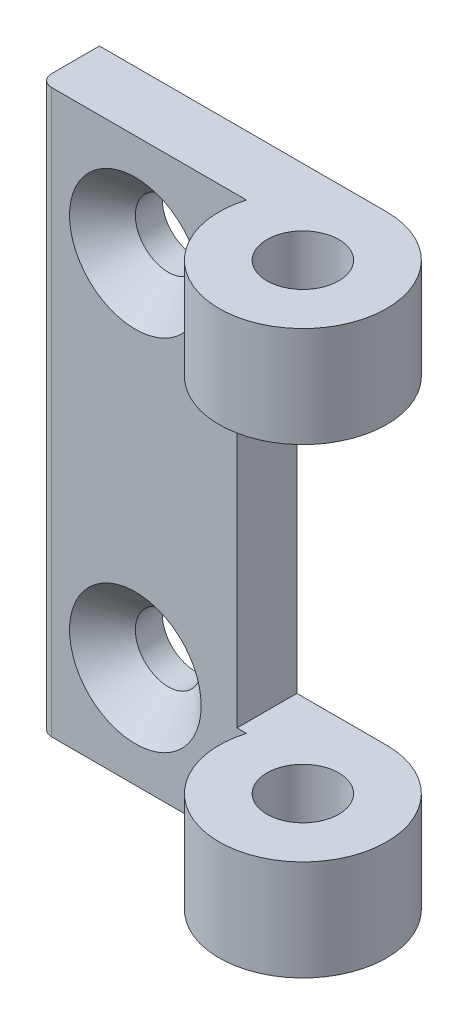
ISO-10303-21;
HEADER;
FILE_DESCRIPTION(('STEP AP214'),'2;1');
FILE_NAME('part.step','',(''),(''),'','','');
FILE_SCHEMA(('AUTOMOTIVE_DESIGN { 1 0 10303 214 1 1 1 1 }'));
ENDSEC;
DATA;
#1=APPLICATION_CONTEXT('core data for automotive mechanical design processes');
#2=APPLICATION_PROTOCOL_DEFINITION('international standard','automotive_design',2000,#1);
#3=PRODUCT_CONTEXT('',#1,'mechanical');
#4=PRODUCT('Part','Part','',(#3));
#5=PRODUCT_RELATED_PRODUCT_CATEGORY('part','',(#4));
#6=PRODUCT_DEFINITION_FORMATION('','',#4);
#7=PRODUCT_DEFINITION_CONTEXT('part definition',#1,'design');
#8=PRODUCT_DEFINITION('design','',#6,#7);
#9=PRODUCT_DEFINITION_SHAPE('','',#8);
#10=(LENGTH_UNIT() NAMED_UNIT(*) SI_UNIT(.MILLI.,.METRE.));
#11=(NAMED_UNIT(*) PLANE_ANGLE_UNIT() SI_UNIT($,.RADIAN.));
#12=(NAMED_UNIT(*) SI_UNIT($,.STERADIAN.) SOLID_ANGLE_UNIT());
#13=UNCERTAINTY_MEASURE_WITH_UNIT(LENGTH_MEASURE(1.E-05),#10,'distance_accuracy_value','');
#14=(GEOMETRIC_REPRESENTATION_CONTEXT(3) GLOBAL_UNCERTAINTY_ASSIGNED_CONTEXT((#13)) GLOBAL_UNIT_ASSIGNED_CONTEXT((#10,
#11,#12)) REPRESENTATION_CONTEXT('',''));
#15=CARTESIAN_POINT('',(0.,0.,0.));
#16=DIRECTION('',(0.,0.,1.));
#17=DIRECTION('',(1.,0.,0.));
#18=AXIS2_PLACEMENT_3D('',#15,#16,#17);
#19=CARTESIAN_POINT('',(-16.,-15.,-2.00000000000955));
#20=DIRECTION('',(0.,0.,1.));
#21=DIRECTION('',(1.,0.,0.));
#22=AXIS2_PLACEMENT_3D('',#19,#20,#21);
#23=CONICAL_SURFACE('',#22,5.49999999996407,0.785398163397448);
#24=CARTESIAN_POINT('',(-16.,-15.,-4.75));
#25=DIRECTION('',(0.,0.,-1.));
#26=DIRECTION('',(-1.,0.,0.));
#27=AXIS2_PLACEMENT_3D('',#24,#25,#26);
#28=CIRCLE('',#27,2.75);
#29=CARTESIAN_POINT('',(-18.75,-15.,-4.75));
#30=VERTEX_POINT('',#29);
#31=EDGE_CURVE('E125',#30,#30,#28,.T.);
#32=ORIENTED_EDGE('',*,*,#31,.T.);
#33=EDGE_LOOP('',(#32));
#34=FACE_BOUND('',#33,.T.);
#35=CARTESIAN_POINT('',(-16.,-15.,-2.00000000000955));
#36=DIRECTION('',(0.,0.,1.));
#37=DIRECTION('',(1.,0.,0.));
#38=AXIS2_PLACEMENT_3D('',#35,#36,#37);
#39=CIRCLE('',#38,5.49999999996407);
#40=CARTESIAN_POINT('',(-10.5000000000359,-15.,-2.00000000000955));
#41=VERTEX_POINT('',#40);
#42=EDGE_CURVE('E83',#41,#41,#39,.F.);
#43=ORIENTED_EDGE('',*,*,#42,.F.);
#44=EDGE_LOOP('',(#43));
#45=FACE_BOUND('',#44,.T.);
#46=ADVANCED_FACE('F15',(#34,#45),#23,.F.);
#47=CARTESIAN_POINT('',(-16.,15.,-2.00000000000955));
#48=DIRECTION('',(0.,0.,1.));
#49=DIRECTION('',(1.,0.,0.));
#50=AXIS2_PLACEMENT_3D('',#47,#48,#49);
#51=CONICAL_SURFACE('',#50,5.49999999996407,0.785398163397448);
#52=CARTESIAN_POINT('',(-16.,15.,-4.75));
#53=DIRECTION('',(0.,0.,-1.));
#54=DIRECTION('',(-1.,0.,0.));
#55=AXIS2_PLACEMENT_3D('',#52,#53,#54);
#56=CIRCLE('',#55,2.75);
#57=CARTESIAN_POINT('',(-18.75,15.,-4.75));
#58=VERTEX_POINT('',#57);
#59=EDGE_CURVE('E122',#58,#58,#56,.T.);
#60=ORIENTED_EDGE('',*,*,#59,.T.);
#61=EDGE_LOOP('',(#60));
#62=FACE_BOUND('',#61,.T.);
#63=CARTESIAN_POINT('',(-16.,15.,-2.00000000000955));
#64=DIRECTION('',(0.,0.,1.));
#65=DIRECTION('',(1.,0.,0.));
#66=AXIS2_PLACEMENT_3D('',#63,#64,#65);
#67=CIRCLE('',#66,5.49999999996407);
#68=CARTESIAN_POINT('',(-10.5000000000359,15.,-2.00000000000955));
#69=VERTEX_POINT('',#68);
#70=EDGE_CURVE('E130',#69,#69,#67,.F.);
#71=ORIENTED_EDGE('',*,*,#70,.F.);
#72=EDGE_LOOP('',(#71));
#73=FACE_BOUND('',#72,.T.);
#74=ADVANCED_FACE('F175',(#62,#73),#51,.F.);
#75=CARTESIAN_POINT('',(-23.,23.5,-3.));
#76=DIRECTION('',(0.,1.,0.));
#77=DIRECTION('',(0.,0.,1.));
#78=AXIS2_PLACEMENT_3D('',#75,#76,#77);
#79=CYLINDRICAL_SURFACE('',#78,1.);
#80=CARTESIAN_POINT('',(-23.,23.5,-3.));
#81=DIRECTION('',(0.,1.,0.));
#82=DIRECTION('',(0.,0.,1.));
#83=AXIS2_PLACEMENT_3D('',#80,#81,#82);
#84=CIRCLE('',#83,1.);
#85=CARTESIAN_POINT('',(-23.,23.5,-2.));
#86=VERTEX_POINT('',#85);
#87=CARTESIAN_POINT('',(-24.,23.5,-3.));
#88=VERTEX_POINT('',#87);
#89=EDGE_CURVE('E121',#86,#88,#84,.F.);
#90=ORIENTED_EDGE('',*,*,#89,.T.);
#91=DIRECTION('',(0.,1.,0.));
#92=VECTOR('',#91,1.);
#93=CARTESIAN_POINT('',(-24.,23.5,-3.));
#94=LINE('',#93,#92);
#95=CARTESIAN_POINT('',(-24.,-23.5,-3.));
#96=VERTEX_POINT('',#95);
#97=EDGE_CURVE('E73',#88,#96,#94,.F.);
#98=ORIENTED_EDGE('',*,*,#97,.T.);
#99=CARTESIAN_POINT('',(-23.,-23.5,-3.));
#100=DIRECTION('',(0.,1.,0.));
#101=DIRECTION('',(0.,0.,1.));
#102=AXIS2_PLACEMENT_3D('',#99,#100,#101);
#103=CIRCLE('',#102,1.);
#104=CARTESIAN_POINT('',(-23.,-23.5,-2.));
#105=VERTEX_POINT('',#104);
#106=EDGE_CURVE('E18',#96,#105,#103,.T.);
#107=ORIENTED_EDGE('',*,*,#106,.T.);
#108=DIRECTION('',(0.,1.,0.));
#109=VECTOR('',#108,1.);
#110=CARTESIAN_POINT('',(-23.,0.,-2.));
#111=LINE('',#110,#109);
#112=EDGE_CURVE('E70',#86,#105,#111,.F.);
#113=ORIENTED_EDGE('',*,*,#112,.F.);
#114=EDGE_LOOP('',(#90,#98,#107,#113));
#115=FACE_BOUND('',#114,.T.);
#116=ADVANCED_FACE('F69',(#115),#79,.T.);
#117=CARTESIAN_POINT('',(0.,-23.5,0.));
#118=DIRECTION('',(0.,1.,0.));
#119=DIRECTION('',(0.,0.,1.));
#120=AXIS2_PLACEMENT_3D('',#117,#118,#119);
#121=CYLINDRICAL_SURFACE('',#120,3.);
#122=CARTESIAN_POINT('',(0.,-15.1,0.));
#123=DIRECTION('',(0.,1.,0.));
#124=DIRECTION('',(0.,0.,1.));
#125=AXIS2_PLACEMENT_3D('',#122,#123,#124);
#126=CIRCLE('',#125,3.);
#127=CARTESIAN_POINT('',(0.,-15.1,3.));
#128=VERTEX_POINT('',#127);
#129=EDGE_CURVE('E144',#128,#128,#126,.T.);
#130=ORIENTED_EDGE('',*,*,#129,.T.);
#131=EDGE_LOOP('',(#130));
#132=FACE_BOUND('',#131,.T.);
#133=CARTESIAN_POINT('',(0.,-23.5,0.));
#134=DIRECTION('',(0.,1.,0.));
#135=DIRECTION('',(0.,0.,1.));
#136=AXIS2_PLACEMENT_3D('',#133,#134,#135);
#137=CIRCLE('',#136,3.);
#138=CARTESIAN_POINT('',(0.,-23.5,3.));
#139=VERTEX_POINT('',#138);
#140=EDGE_CURVE('E94',#139,#139,#137,.F.);
#141=ORIENTED_EDGE('',*,*,#140,.T.);
#142=EDGE_LOOP('',(#141));
#143=FACE_BOUND('',#142,.T.);
#144=ADVANCED_FACE('F234',(#132,#143),#121,.F.);
#145=CARTESIAN_POINT('',(0.,-23.5,0.));
#146=DIRECTION('',(0.,1.,0.));
#147=DIRECTION('',(0.,0.,1.));
#148=AXIS2_PLACEMENT_3D('',#145,#146,#147);
#149=CYLINDRICAL_SURFACE('',#148,3.);
#150=CARTESIAN_POINT('',(0.,23.5,0.));
#151=DIRECTION('',(0.,1.,0.));
#152=DIRECTION('',(0.,0.,1.));
#153=AXIS2_PLACEMENT_3D('',#150,#151,#152);
#154=CIRCLE('',#153,3.);
#155=CARTESIAN_POINT('',(0.,23.5,3.));
#156=VERTEX_POINT('',#155);
#157=EDGE_CURVE('E112',#156,#156,#154,.T.);
#158=ORIENTED_EDGE('',*,*,#157,.T.);
#159=EDGE_LOOP('',(#158));
#160=FACE_BOUND('',#159,.T.);
#161=CARTESIAN_POINT('',(0.,15.1,0.));
#162=DIRECTION('',(0.,1.,0.));
#163=DIRECTION('',(0.,0.,1.));
#164=AXIS2_PLACEMENT_3D('',#161,#162,#163);
#165=CIRCLE('',#164,3.);
#166=CARTESIAN_POINT('',(0.,15.1,3.));
#167=VERTEX_POINT('',#166);
#168=EDGE_CURVE('E140',#167,#167,#165,.F.);
#169=ORIENTED_EDGE('',*,*,#168,.T.);
#170=EDGE_LOOP('',(#169));
#171=FACE_BOUND('',#170,.T.);
#172=ADVANCED_FACE('F230',(#160,#171),#149,.F.);
#173=CARTESIAN_POINT('',(0.,0.,-2.));
#174=DIRECTION('',(0.,0.,1.));
#175=DIRECTION('',(1.,0.,0.));
#176=AXIS2_PLACEMENT_3D('',#173,#174,#175);
#177=PLANE('',#176);
#178=ORIENTED_EDGE('',*,*,#70,.T.);
#179=EDGE_LOOP('',(#178));
#180=FACE_BOUND('',#179,.T.);
#181=ORIENTED_EDGE('',*,*,#42,.T.);
#182=EDGE_LOOP('',(#181));
#183=FACE_BOUND('',#182,.T.);
#184=DIRECTION('',(0.,1.,0.));
#185=VECTOR('',#184,1.);
#186=CARTESIAN_POINT('',(-6.70820393249937,-23.5,-2.));
#187=LINE('',#186,#185);
#188=CARTESIAN_POINT('',(-6.70820393249937,23.5,-2.));
#189=VERTEX_POINT('',#188);
#190=CARTESIAN_POINT('',(-6.70820393249937,15.1,-2.));
#191=VERTEX_POINT('',#190);
#192=EDGE_CURVE('E133',#189,#191,#187,.F.);
#193=ORIENTED_EDGE('',*,*,#192,.F.);
#194=DIRECTION('',(1.,0.,0.));
#195=VECTOR('',#194,1.);
#196=CARTESIAN_POINT('',(0.,23.5,-2.));
#197=LINE('',#196,#195);
#198=EDGE_CURVE('E82',#189,#86,#197,.F.);
#199=ORIENTED_EDGE('',*,*,#198,.T.);
#200=ORIENTED_EDGE('',*,*,#112,.T.);
#201=DIRECTION('',(1.,0.,0.));
#202=VECTOR('',#201,1.);
#203=CARTESIAN_POINT('',(7.,-23.5,-2.));
#204=LINE('',#203,#202);
#205=CARTESIAN_POINT('',(-6.70820393249937,-23.5,-2.));
#206=VERTEX_POINT('',#205);
#207=EDGE_CURVE('E79',#105,#206,#204,.T.);
#208=ORIENTED_EDGE('',*,*,#207,.T.);
#209=DIRECTION('',(0.,1.,0.));
#210=VECTOR('',#209,1.);
#211=CARTESIAN_POINT('',(-6.70820393249937,-23.5,-2.));
#212=LINE('',#211,#210);
#213=CARTESIAN_POINT('',(-6.70820393249937,-15.1,-2.));
#214=VERTEX_POINT('',#213);
#215=EDGE_CURVE('E92',#214,#206,#212,.F.);
#216=ORIENTED_EDGE('',*,*,#215,.F.);
#217=DIRECTION('',(1.,0.,0.));
#218=VECTOR('',#217,1.);
#219=CARTESIAN_POINT('',(7.,-15.1,-2.));
#220=LINE('',#219,#218);
#221=CARTESIAN_POINT('',(-7.5,-15.1,-2.));
#222=VERTEX_POINT('',#221);
#223=EDGE_CURVE('E161',#214,#222,#220,.F.);
#224=ORIENTED_EDGE('',*,*,#223,.T.);
#225=DIRECTION('',(0.,1.,0.));
#226=VECTOR('',#225,1.);
#227=CARTESIAN_POINT('',(-7.5,-15.1,-2.));
#228=LINE('',#227,#226);
#229=CARTESIAN_POINT('',(-7.5,15.1,-2.));
#230=VERTEX_POINT('',#229);
#231=EDGE_CURVE('E137',#222,#230,#228,.T.);
#232=ORIENTED_EDGE('',*,*,#231,.T.);
#233=DIRECTION('',(-1.,0.,0.));
#234=VECTOR('',#233,1.);
#235=CARTESIAN_POINT('',(-7.5,15.1,-2.));
#236=LINE('',#235,#234);
#237=EDGE_CURVE('E154',#230,#191,#236,.F.);
#238=ORIENTED_EDGE('',*,*,#237,.T.);
#239=EDGE_LOOP('',(#193,#199,#200,#208,#216,#224,#232,#238));
#240=FACE_BOUND('',#239,.T.);
#241=ADVANCED_FACE('F78',(#180,#183,#240),#177,.T.);
#242=CARTESIAN_POINT('',(-16.,-15.,-2.));
#243=DIRECTION('',(0.,0.,-1.));
#244=DIRECTION('',(-1.,0.,0.));
#245=AXIS2_PLACEMENT_3D('',#242,#243,#244);
#246=CYLINDRICAL_SURFACE('',#245,2.75);
#247=CARTESIAN_POINT('',(-16.,-15.,-7.));
#248=DIRECTION('',(0.,0.,-1.));
#249=DIRECTION('',(-1.,0.,0.));
#250=AXIS2_PLACEMENT_3D('',#247,#248,#249);
#251=CIRCLE('',#250,2.75);
#252=CARTESIAN_POINT('',(-18.75,-15.,-7.));
#253=VERTEX_POINT('',#252);
#254=EDGE_CURVE('E135',#253,#253,#251,.T.);
#255=ORIENTED_EDGE('',*,*,#254,.T.);
#256=EDGE_LOOP('',(#255));
#257=FACE_BOUND('',#256,.T.);
#258=ORIENTED_EDGE('',*,*,#31,.F.);
#259=EDGE_LOOP('',(#258));
#260=FACE_BOUND('',#259,.T.);
#261=ADVANCED_FACE('F223',(#257,#260),#246,.F.);
#262=CARTESIAN_POINT('',(-16.,15.,-2.));
#263=DIRECTION('',(0.,0.,-1.));
#264=DIRECTION('',(-1.,0.,0.));
#265=AXIS2_PLACEMENT_3D('',#262,#263,#264);
#266=CYLINDRICAL_SURFACE('',#265,2.75);
#267=CARTESIAN_POINT('',(-16.,15.,-7.));
#268=DIRECTION('',(0.,0.,-1.));
#269=DIRECTION('',(-1.,0.,0.));
#270=AXIS2_PLACEMENT_3D('',#267,#268,#269);
#271=CIRCLE('',#270,2.75);
#272=CARTESIAN_POINT('',(-18.75,15.,-7.));
#273=VERTEX_POINT('',#272);
#274=EDGE_CURVE('E117',#273,#273,#271,.T.);
#275=ORIENTED_EDGE('',*,*,#274,.T.);
#276=EDGE_LOOP('',(#275));
#277=FACE_BOUND('',#276,.T.);
#278=ORIENTED_EDGE('',*,*,#59,.F.);
#279=EDGE_LOOP('',(#278));
#280=FACE_BOUND('',#279,.T.);
#281=ADVANCED_FACE('F219',(#277,#280),#266,.F.);
#282=CARTESIAN_POINT('',(0.,23.5,0.));
#283=DIRECTION('',(0.,-1.,0.));
#284=DIRECTION('',(0.,0.,-1.));
#285=AXIS2_PLACEMENT_3D('',#282,#283,#284);
#286=PLANE('',#285);
#287=ORIENTED_EDGE('',*,*,#157,.F.);
#288=EDGE_LOOP('',(#287));
#289=FACE_BOUND('',#288,.T.);
#290=DIRECTION('',(1.,0.,0.));
#291=VECTOR('',#290,1.);
#292=CARTESIAN_POINT('',(0.,23.5,-7.));
#293=LINE('',#292,#291);
#294=CARTESIAN_POINT('',(0.,23.5,-7.));
#295=VERTEX_POINT('',#294);
#296=CARTESIAN_POINT('',(-24.,23.5,-7.));
#297=VERTEX_POINT('',#296);
#298=EDGE_CURVE('E106',#295,#297,#293,.F.);
#299=ORIENTED_EDGE('',*,*,#298,.T.);
#300=DIRECTION('',(0.,0.,-1.));
#301=VECTOR('',#300,1.);
#302=CARTESIAN_POINT('',(-24.,23.5,-2.));
#303=LINE('',#302,#301);
#304=EDGE_CURVE('E109',#297,#88,#303,.F.);
#305=ORIENTED_EDGE('',*,*,#304,.T.);
#306=ORIENTED_EDGE('',*,*,#89,.F.);
#307=ORIENTED_EDGE('',*,*,#198,.F.);
#308=CARTESIAN_POINT('',(0.,23.5,0.));
#309=DIRECTION('',(0.,1.,0.));
#310=DIRECTION('',(0.,0.,1.));
#311=AXIS2_PLACEMENT_3D('',#308,#309,#310);
#312=CIRCLE('',#311,7.);
#313=EDGE_CURVE('E136',#295,#189,#312,.F.);
#314=ORIENTED_EDGE('',*,*,#313,.F.);
#315=EDGE_LOOP('',(#299,#305,#306,#307,#314));
#316=FACE_BOUND('',#315,.T.);
#317=ADVANCED_FACE('F215',(#289,#316),#286,.F.);
#318=CARTESIAN_POINT('',(-24.,23.5,-2.));
#319=DIRECTION('',(1.,0.,0.));
#320=DIRECTION('',(0.,0.,-1.));
#321=AXIS2_PLACEMENT_3D('',#318,#319,#320);
#322=PLANE('',#321);
#323=ORIENTED_EDGE('',*,*,#97,.F.);
#324=ORIENTED_EDGE('',*,*,#304,.F.);
#325=DIRECTION('',(0.,1.,0.));
#326=VECTOR('',#325,1.);
#327=CARTESIAN_POINT('',(-24.,0.,-7.));
#328=LINE('',#327,#326);
#329=CARTESIAN_POINT('',(-24.,-23.5,-7.));
#330=VERTEX_POINT('',#329);
#331=EDGE_CURVE('E102',#297,#330,#328,.F.);
#332=ORIENTED_EDGE('',*,*,#331,.T.);
#333=DIRECTION('',(0.,0.,1.));
#334=VECTOR('',#333,1.);
#335=CARTESIAN_POINT('',(-24.,-23.5,0.));
#336=LINE('',#335,#334);
#337=EDGE_CURVE('E90',#330,#96,#336,.T.);
#338=ORIENTED_EDGE('',*,*,#337,.T.);
#339=EDGE_LOOP('',(#323,#324,#332,#338));
#340=FACE_BOUND('',#339,.T.);
#341=ADVANCED_FACE('F212',(#340),#322,.F.);
#342=CARTESIAN_POINT('',(7.,-23.5,0.));
#343=DIRECTION('',(0.,1.,0.));
#344=DIRECTION('',(0.,0.,1.));
#345=AXIS2_PLACEMENT_3D('',#342,#343,#344);
#346=PLANE('',#345);
#347=ORIENTED_EDGE('',*,*,#106,.F.);
#348=ORIENTED_EDGE('',*,*,#337,.F.);
#349=DIRECTION('',(1.,0.,0.));
#350=VECTOR('',#349,1.);
#351=CARTESIAN_POINT('',(0.,-23.5,-7.));
#352=LINE('',#351,#350);
#353=CARTESIAN_POINT('',(0.,-23.5,-7.));
#354=VERTEX_POINT('',#353);
#355=EDGE_CURVE('E105',#330,#354,#352,.T.);
#356=ORIENTED_EDGE('',*,*,#355,.T.);
#357=CARTESIAN_POINT('',(0.,-23.5,0.));
#358=DIRECTION('',(0.,1.,0.));
#359=DIRECTION('',(0.,0.,1.));
#360=AXIS2_PLACEMENT_3D('',#357,#358,#359);
#361=CIRCLE('',#360,7.);
#362=EDGE_CURVE('E89',#206,#354,#361,.T.);
#363=ORIENTED_EDGE('',*,*,#362,.F.);
#364=ORIENTED_EDGE('',*,*,#207,.F.);
#365=EDGE_LOOP('',(#347,#348,#356,#363,#364));
#366=FACE_BOUND('',#365,.T.);
#367=ORIENTED_EDGE('',*,*,#140,.F.);
#368=EDGE_LOOP('',(#367));
#369=FACE_BOUND('',#368,.T.);
#370=ADVANCED_FACE('F86',(#366,#369),#346,.F.);
#371=CARTESIAN_POINT('',(0.,-23.5,0.));
#372=DIRECTION('',(0.,1.,0.));
#373=DIRECTION('',(0.,0.,1.));
#374=AXIS2_PLACEMENT_3D('',#371,#372,#373);
#375=CYLINDRICAL_SURFACE('',#374,7.);
#376=CARTESIAN_POINT('',(0.,-15.1,0.));
#377=DIRECTION('',(0.,1.,0.));
#378=DIRECTION('',(0.,0.,1.));
#379=AXIS2_PLACEMENT_3D('',#376,#377,#378);
#380=CIRCLE('',#379,7.);
#381=CARTESIAN_POINT('',(0.,-15.1,-7.));
#382=VERTEX_POINT('',#381);
#383=EDGE_CURVE('E158',#382,#214,#380,.F.);
#384=ORIENTED_EDGE('',*,*,#383,.T.);
#385=ORIENTED_EDGE('',*,*,#215,.T.);
#386=ORIENTED_EDGE('',*,*,#362,.T.);
#387=DIRECTION('',(0.,1.,0.));
#388=VECTOR('',#387,1.);
#389=CARTESIAN_POINT('',(0.,0.,-7.));
#390=LINE('',#389,#388);
#391=EDGE_CURVE('E398',#354,#382,#390,.T.);
#392=ORIENTED_EDGE('',*,*,#391,.T.);
#393=EDGE_LOOP('',(#384,#385,#386,#392));
#394=FACE_BOUND('',#393,.T.);
#395=ADVANCED_FACE('F205',(#394),#375,.T.);
#396=CARTESIAN_POINT('',(7.,-15.1,7.));
#397=DIRECTION('',(0.,-1.,0.));
#398=DIRECTION('',(0.,0.,-1.));
#399=AXIS2_PLACEMENT_3D('',#396,#397,#398);
#400=PLANE('',#399);
#401=ORIENTED_EDGE('',*,*,#383,.F.);
#402=DIRECTION('',(1.,0.,0.));
#403=VECTOR('',#402,1.);
#404=CARTESIAN_POINT('',(0.,-15.1,-7.));
#405=LINE('',#404,#403);
#406=CARTESIAN_POINT('',(-7.5,-15.1,-7.));
#407=VERTEX_POINT('',#406);
#408=EDGE_CURVE('E381',#382,#407,#405,.F.);
#409=ORIENTED_EDGE('',*,*,#408,.T.);
#410=DIRECTION('',(0.,0.,1.));
#411=VECTOR('',#410,1.);
#412=CARTESIAN_POINT('',(-7.5,-15.1,7.));
#413=LINE('',#412,#411);
#414=EDGE_CURVE('E141',#407,#222,#413,.T.);
#415=ORIENTED_EDGE('',*,*,#414,.T.);
#416=ORIENTED_EDGE('',*,*,#223,.F.);
#417=EDGE_LOOP('',(#401,#409,#415,#416));
#418=FACE_BOUND('',#417,.T.);
#419=ORIENTED_EDGE('',*,*,#129,.F.);
#420=EDGE_LOOP('',(#419));
#421=FACE_BOUND('',#420,.T.);
#422=ADVANCED_FACE('F201',(#418,#421),#400,.F.);
#423=CARTESIAN_POINT('',(-7.5,-15.1,7.));
#424=DIRECTION('',(-1.,0.,0.));
#425=DIRECTION('',(0.,0.,1.));
#426=AXIS2_PLACEMENT_3D('',#423,#424,#425);
#427=PLANE('',#426);
#428=ORIENTED_EDGE('',*,*,#414,.F.);
#429=DIRECTION('',(0.,1.,0.));
#430=VECTOR('',#429,1.);
#431=CARTESIAN_POINT('',(-7.5,0.,-7.));
#432=LINE('',#431,#430);
#433=CARTESIAN_POINT('',(-7.5,15.1,-7.));
#434=VERTEX_POINT('',#433);
#435=EDGE_CURVE('E379',#407,#434,#432,.T.);
#436=ORIENTED_EDGE('',*,*,#435,.T.);
#437=DIRECTION('',(0.,0.,1.));
#438=VECTOR('',#437,1.);
#439=CARTESIAN_POINT('',(-7.5,15.1,7.));
#440=LINE('',#439,#438);
#441=EDGE_CURVE('E157',#434,#230,#440,.T.);
#442=ORIENTED_EDGE('',*,*,#441,.T.);
#443=ORIENTED_EDGE('',*,*,#231,.F.);
#444=EDGE_LOOP('',(#428,#436,#442,#443));
#445=FACE_BOUND('',#444,.T.);
#446=ADVANCED_FACE('F197',(#445),#427,.F.);
#447=CARTESIAN_POINT('',(-7.5,15.1,7.));
#448=DIRECTION('',(0.,1.,0.));
#449=DIRECTION('',(-1.,0.,0.));
#450=AXIS2_PLACEMENT_3D('',#447,#448,#449);
#451=PLANE('',#450);
#452=ORIENTED_EDGE('',*,*,#441,.F.);
#453=DIRECTION('',(1.,0.,0.));
#454=VECTOR('',#453,1.);
#455=CARTESIAN_POINT('',(0.,15.1,-7.));
#456=LINE('',#455,#454);
#457=CARTESIAN_POINT('',(0.,15.1,-7.));
#458=VERTEX_POINT('',#457);
#459=EDGE_CURVE('E24',#434,#458,#456,.T.);
#460=ORIENTED_EDGE('',*,*,#459,.T.);
#461=CARTESIAN_POINT('',(0.,15.1,0.));
#462=DIRECTION('',(0.,1.,0.));
#463=DIRECTION('',(0.,0.,1.));
#464=AXIS2_PLACEMENT_3D('',#461,#462,#463);
#465=CIRCLE('',#464,7.);
#466=EDGE_CURVE('E32',#191,#458,#465,.T.);
#467=ORIENTED_EDGE('',*,*,#466,.F.);
#468=ORIENTED_EDGE('',*,*,#237,.F.);
#469=EDGE_LOOP('',(#452,#460,#467,#468));
#470=FACE_BOUND('',#469,.T.);
#471=ORIENTED_EDGE('',*,*,#168,.F.);
#472=EDGE_LOOP('',(#471));
#473=FACE_BOUND('',#472,.T.);
#474=ADVANCED_FACE('F190',(#470,#473),#451,.F.);
#475=CARTESIAN_POINT('',(0.,-23.5,0.));
#476=DIRECTION('',(0.,1.,0.));
#477=DIRECTION('',(0.,0.,1.));
#478=AXIS2_PLACEMENT_3D('',#475,#476,#477);
#479=CYLINDRICAL_SURFACE('',#478,7.);
#480=ORIENTED_EDGE('',*,*,#313,.T.);
#481=ORIENTED_EDGE('',*,*,#192,.T.);
#482=ORIENTED_EDGE('',*,*,#466,.T.);
#483=DIRECTION('',(0.,1.,0.));
#484=VECTOR('',#483,1.);
#485=CARTESIAN_POINT('',(0.,0.,-7.));
#486=LINE('',#485,#484);
#487=EDGE_CURVE('E10',#458,#295,#486,.T.);
#488=ORIENTED_EDGE('',*,*,#487,.T.);
#489=EDGE_LOOP('',(#480,#481,#482,#488));
#490=FACE_BOUND('',#489,.T.);
#491=ADVANCED_FACE('F184',(#490),#479,.T.);
#492=CARTESIAN_POINT('',(0.,0.,-7.));
#493=DIRECTION('',(0.,0.,1.));
#494=DIRECTION('',(1.,0.,0.));
#495=AXIS2_PLACEMENT_3D('',#492,#493,#494);
#496=PLANE('',#495);
#497=ORIENTED_EDGE('',*,*,#459,.F.);
#498=ORIENTED_EDGE('',*,*,#435,.F.);
#499=ORIENTED_EDGE('',*,*,#408,.F.);
#500=ORIENTED_EDGE('',*,*,#391,.F.);
#501=ORIENTED_EDGE('',*,*,#355,.F.);
#502=ORIENTED_EDGE('',*,*,#331,.F.);
#503=ORIENTED_EDGE('',*,*,#298,.F.);
#504=ORIENTED_EDGE('',*,*,#487,.F.);
#505=EDGE_LOOP('',(#497,#498,#499,#500,#501,#502,#503,#504));
#506=FACE_BOUND('',#505,.T.);
#507=ORIENTED_EDGE('',*,*,#274,.F.);
#508=EDGE_LOOP('',(#507));
#509=FACE_BOUND('',#508,.T.);
#510=ORIENTED_EDGE('',*,*,#254,.F.);
#511=EDGE_LOOP('',(#510));
#512=FACE_BOUND('',#511,.T.);
#513=ADVANCED_FACE('F182',(#506,#509,#512),#496,.F.);
#514=CLOSED_SHELL('',(#46,#74,#116,#144,#172,#241,#261,#281,#317,#341,#370,#395,#422,#446,#474,
#491,#513));
#515=MANIFOLD_SOLID_BREP('B1',#514);
#516=ADVANCED_BREP_SHAPE_REPRESENTATION('',(#18,#515),#14);
#517=SHAPE_DEFINITION_REPRESENTATION(#9,#516);
ENDSEC;
END-ISO-10303-21;
